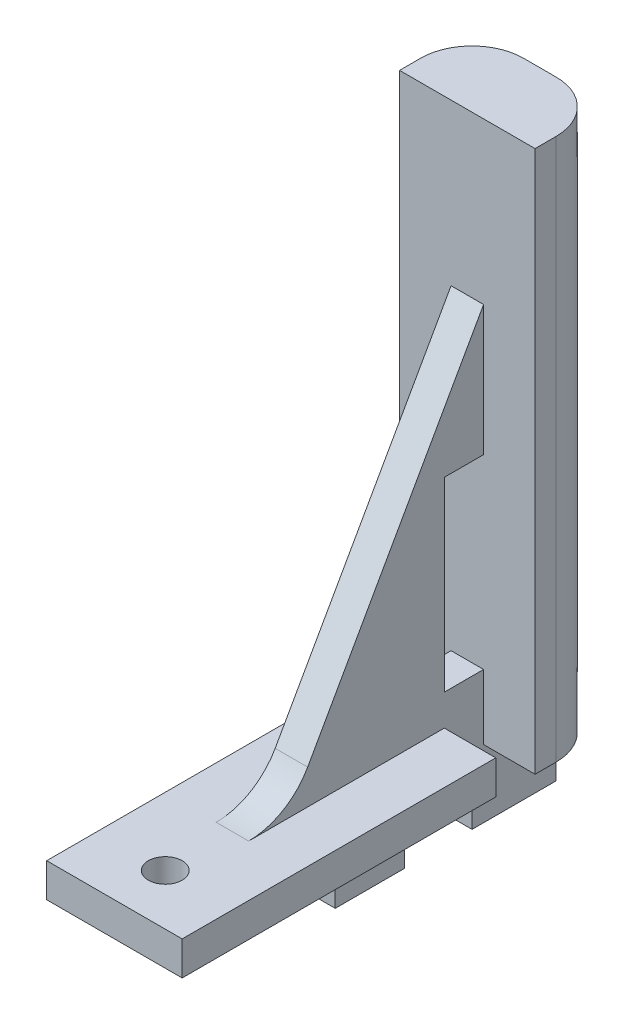
ISO-10303-21;
HEADER;
FILE_DESCRIPTION(('STEP AP214'),'2;1');
FILE_NAME('part.step','',(''),(''),'','','');
FILE_SCHEMA(('AUTOMOTIVE_DESIGN { 1 0 10303 214 1 1 1 1 }'));
ENDSEC;
DATA;
#1=APPLICATION_CONTEXT('core data for automotive mechanical design processes');
#2=APPLICATION_PROTOCOL_DEFINITION('international standard','automotive_design',2000,#1);
#3=PRODUCT_CONTEXT('',#1,'mechanical');
#4=PRODUCT('Part','Part','',(#3));
#5=PRODUCT_RELATED_PRODUCT_CATEGORY('part','',(#4));
#6=PRODUCT_DEFINITION_FORMATION('','',#4);
#7=PRODUCT_DEFINITION_CONTEXT('part definition',#1,'design');
#8=PRODUCT_DEFINITION('design','',#6,#7);
#9=PRODUCT_DEFINITION_SHAPE('','',#8);
#10=(LENGTH_UNIT() NAMED_UNIT(*) SI_UNIT(.MILLI.,.METRE.));
#11=(NAMED_UNIT(*) PLANE_ANGLE_UNIT() SI_UNIT($,.RADIAN.));
#12=(NAMED_UNIT(*) SI_UNIT($,.STERADIAN.) SOLID_ANGLE_UNIT());
#13=UNCERTAINTY_MEASURE_WITH_UNIT(LENGTH_MEASURE(1.E-05),#10,'distance_accuracy_value','');
#14=(GEOMETRIC_REPRESENTATION_CONTEXT(3) GLOBAL_UNCERTAINTY_ASSIGNED_CONTEXT((#13)) GLOBAL_UNIT_ASSIGNED_CONTEXT((#10,
#11,#12)) REPRESENTATION_CONTEXT('',''));
#15=CARTESIAN_POINT('',(0.,0.,0.));
#16=DIRECTION('',(0.,0.,1.));
#17=DIRECTION('',(1.,0.,0.));
#18=AXIS2_PLACEMENT_3D('',#15,#16,#17);
#19=CARTESIAN_POINT('',(-6.35,0.,0.));
#20=DIRECTION('',(1.,0.,0.));
#21=DIRECTION('',(0.,0.,-1.));
#22=AXIS2_PLACEMENT_3D('',#19,#20,#21);
#23=PLANE('',#22);
#24=DIRECTION('',(0.,0.,-1.));
#25=VECTOR('',#24,1.);
#26=CARTESIAN_POINT('',(-6.35,0.,0.));
#27=LINE('',#26,#25);
#28=CARTESIAN_POINT('',(-6.35,0.,-13.1445));
#29=VERTEX_POINT('',#28);
#30=CARTESIAN_POINT('',(-6.35,0.,-15.113));
#31=VERTEX_POINT('',#30);
#32=EDGE_CURVE('E273',#29,#31,#27,.T.);
#33=ORIENTED_EDGE('',*,*,#32,.F.);
#34=DIRECTION('',(0.,1.,0.));
#35=VECTOR('',#34,1.);
#36=CARTESIAN_POINT('',(-6.35,0.,-13.1445));
#37=LINE('',#36,#35);
#38=CARTESIAN_POINT('',(-6.35,50.8,-13.1445));
#39=VERTEX_POINT('',#38);
#40=EDGE_CURVE('E500',#29,#39,#37,.T.);
#41=ORIENTED_EDGE('',*,*,#40,.T.);
#42=DIRECTION('',(0.,0.,1.));
#43=VECTOR('',#42,1.);
#44=CARTESIAN_POINT('',(-6.35,50.8,0.));
#45=LINE('',#44,#43);
#46=CARTESIAN_POINT('',(-6.35,50.8,-15.113));
#47=VERTEX_POINT('',#46);
#48=EDGE_CURVE('E272',#47,#39,#45,.T.);
#49=ORIENTED_EDGE('',*,*,#48,.F.);
#50=DIRECTION('',(0.,1.,0.));
#51=VECTOR('',#50,1.);
#52=CARTESIAN_POINT('',(-6.35,0.,-15.113));
#53=LINE('',#52,#51);
#54=EDGE_CURVE('E325',#47,#31,#53,.F.);
#55=ORIENTED_EDGE('',*,*,#54,.T.);
#56=EDGE_LOOP('',(#33,#41,#49,#55));
#57=FACE_BOUND('',#56,.T.);
#58=ADVANCED_FACE('F41',(#57),#23,.F.);
#59=DIRECTION('',(0.,-1.,0.));
#60=VECTOR('',#59,1.);
#61=CARTESIAN_POINT('',(-6.35,0.,-9.4615));
#62=LINE('',#61,#60);
#63=CARTESIAN_POINT('',(-6.35,3.17500000000002,-9.4615));
#64=VERTEX_POINT('',#63);
#65=CARTESIAN_POINT('',(-6.35,0.,-9.4615));
#66=VERTEX_POINT('',#65);
#67=EDGE_CURVE('E248',#64,#66,#62,.T.);
#68=ORIENTED_EDGE('',*,*,#67,.T.);
#69=CARTESIAN_POINT('',(-6.35,0.,19.939));
#70=VERTEX_POINT('',#69);
#71=EDGE_CURVE('E263',#70,#66,#27,.T.);
#72=ORIENTED_EDGE('',*,*,#71,.F.);
#73=DIRECTION('',(0.,1.,0.));
#74=VECTOR('',#73,1.);
#75=CARTESIAN_POINT('',(-6.35,0.,19.939));
#76=LINE('',#75,#74);
#77=CARTESIAN_POINT('',(-6.35,3.175,19.939));
#78=VERTEX_POINT('',#77);
#79=EDGE_CURVE('E280',#70,#78,#76,.T.);
#80=ORIENTED_EDGE('',*,*,#79,.T.);
#81=DIRECTION('',(0.,0.,1.));
#82=VECTOR('',#81,1.);
#83=CARTESIAN_POINT('',(-6.35,3.17500000000002,0.));
#84=LINE('',#83,#82);
#85=EDGE_CURVE('E265',#64,#78,#84,.T.);
#86=ORIENTED_EDGE('',*,*,#85,.F.);
#87=EDGE_LOOP('',(#68,#72,#80,#86));
#88=FACE_BOUND('',#87,.T.);
#89=ADVANCED_FACE('F261',(#88),#23,.F.);
#90=CARTESIAN_POINT('',(6.35,0.,0.));
#91=DIRECTION('',(0.,1.,0.));
#92=DIRECTION('',(0.,0.,1.));
#93=AXIS2_PLACEMENT_3D('',#90,#91,#92);
#94=PLANE('',#93);
#95=DIRECTION('',(-1.,0.,0.));
#96=VECTOR('',#95,1.);
#97=CARTESIAN_POINT('',(5.59819804554749,0.,-13.1445));
#98=LINE('',#97,#96);
#99=CARTESIAN_POINT('',(-1.524,0.,-13.1445));
#100=VERTEX_POINT('',#99);
#101=EDGE_CURVE('E256',#100,#29,#98,.T.);
#102=ORIENTED_EDGE('',*,*,#101,.T.);
#103=ORIENTED_EDGE('',*,*,#32,.T.);
#104=CARTESIAN_POINT('',(-1.524,0.,-15.113));
#105=DIRECTION('',(0.,1.,0.));
#106=DIRECTION('',(0.,0.,1.));
#107=AXIS2_PLACEMENT_3D('',#104,#105,#106);
#108=CIRCLE('',#107,4.826);
#109=CARTESIAN_POINT('',(-1.524,0.,-19.939));
#110=VERTEX_POINT('',#109);
#111=EDGE_CURVE('E333',#31,#110,#108,.F.);
#112=ORIENTED_EDGE('',*,*,#111,.T.);
#113=DIRECTION('',(0.,0.,-1.));
#114=VECTOR('',#113,1.);
#115=CARTESIAN_POINT('',(-1.524,0.,0.));
#116=LINE('',#115,#114);
#117=EDGE_CURVE('E456',#100,#110,#116,.T.);
#118=ORIENTED_EDGE('',*,*,#117,.F.);
#119=EDGE_LOOP('',(#102,#103,#112,#118));
#120=FACE_BOUND('',#119,.T.);
#121=ADVANCED_FACE('F604',(#120),#94,.F.);
#122=DIRECTION('',(-1.,0.,0.));
#123=VECTOR('',#122,1.);
#124=CARTESIAN_POINT('',(1.524,0.,0.762));
#125=LINE('',#124,#123);
#126=CARTESIAN_POINT('',(1.524,0.,0.762));
#127=VERTEX_POINT('',#126);
#128=CARTESIAN_POINT('',(-1.524,0.,0.762));
#129=VERTEX_POINT('',#128);
#130=EDGE_CURVE('E449',#127,#129,#125,.T.);
#131=ORIENTED_EDGE('',*,*,#130,.F.);
#132=DIRECTION('',(0.,0.,-1.));
#133=VECTOR('',#132,1.);
#134=CARTESIAN_POINT('',(1.524,0.,0.));
#135=LINE('',#134,#133);
#136=CARTESIAN_POINT('',(1.524,0.,-5.715));
#137=VERTEX_POINT('',#136);
#138=EDGE_CURVE('E419',#127,#137,#135,.T.);
#139=ORIENTED_EDGE('',*,*,#138,.T.);
#140=DIRECTION('',(-1.,0.,0.));
#141=VECTOR('',#140,1.);
#142=CARTESIAN_POINT('',(1.524,0.,-5.715));
#143=LINE('',#142,#141);
#144=CARTESIAN_POINT('',(-1.524,0.,-5.715));
#145=VERTEX_POINT('',#144);
#146=EDGE_CURVE('E453',#137,#145,#143,.T.);
#147=ORIENTED_EDGE('',*,*,#146,.T.);
#148=DIRECTION('',(0.,0.,-1.));
#149=VECTOR('',#148,1.);
#150=CARTESIAN_POINT('',(-1.524,0.,0.));
#151=LINE('',#150,#149);
#152=EDGE_CURVE('E433',#129,#145,#151,.T.);
#153=ORIENTED_EDGE('',*,*,#152,.F.);
#154=EDGE_LOOP('',(#131,#139,#147,#153));
#155=FACE_BOUND('',#154,.T.);
#156=CARTESIAN_POINT('',(0.,0.,15.1765));
#157=DIRECTION('',(0.,-1.,0.));
#158=DIRECTION('',(0.,0.,-1.));
#159=AXIS2_PLACEMENT_3D('',#156,#157,#158);
#160=CIRCLE('',#159,1.5875);
#161=CARTESIAN_POINT('',(0.,0.,13.589));
#162=VERTEX_POINT('',#161);
#163=EDGE_CURVE('E309',#162,#162,#160,.T.);
#164=ORIENTED_EDGE('',*,*,#163,.F.);
#165=EDGE_LOOP('',(#164));
#166=FACE_BOUND('',#165,.T.);
#167=DIRECTION('',(-1.,0.,0.));
#168=VECTOR('',#167,1.);
#169=CARTESIAN_POINT('',(5.59819804554749,0.,-9.4615));
#170=LINE('',#169,#168);
#171=CARTESIAN_POINT('',(-1.524,0.,-9.4615));
#172=VERTEX_POINT('',#171);
#173=EDGE_CURVE('E245',#172,#66,#170,.T.);
#174=ORIENTED_EDGE('',*,*,#173,.F.);
#175=DIRECTION('',(0.,0.,1.));
#176=VECTOR('',#175,1.);
#177=CARTESIAN_POINT('',(-1.524,0.,0.));
#178=LINE('',#177,#176);
#179=CARTESIAN_POINT('',(-1.524,0.,-12.065));
#180=VERTEX_POINT('',#179);
#181=EDGE_CURVE('E255',#180,#172,#178,.T.);
#182=ORIENTED_EDGE('',*,*,#181,.F.);
#183=DIRECTION('',(-1.,0.,0.));
#184=VECTOR('',#183,1.);
#185=CARTESIAN_POINT('',(1.524,0.,-12.065));
#186=LINE('',#185,#184);
#187=CARTESIAN_POINT('',(1.524,0.,-12.065));
#188=VERTEX_POINT('',#187);
#189=EDGE_CURVE('E491',#188,#180,#186,.T.);
#190=ORIENTED_EDGE('',*,*,#189,.F.);
#191=DIRECTION('',(0.,0.,-1.));
#192=VECTOR('',#191,1.);
#193=CARTESIAN_POINT('',(1.524,0.,-9.4615));
#194=LINE('',#193,#192);
#195=CARTESIAN_POINT('',(1.524,0.,-9.4615));
#196=VERTEX_POINT('',#195);
#197=EDGE_CURVE('E549',#196,#188,#194,.T.);
#198=ORIENTED_EDGE('',*,*,#197,.F.);
#199=DIRECTION('',(1.,0.,0.));
#200=VECTOR('',#199,1.);
#201=CARTESIAN_POINT('',(-5.59819804554748,0.,-9.4615));
#202=LINE('',#201,#200);
#203=CARTESIAN_POINT('',(6.35,0.,-9.4615));
#204=VERTEX_POINT('',#203);
#205=EDGE_CURVE('E561',#196,#204,#202,.T.);
#206=ORIENTED_EDGE('',*,*,#205,.T.);
#207=DIRECTION('',(0.,0.,-1.));
#208=VECTOR('',#207,1.);
#209=CARTESIAN_POINT('',(6.35,0.,0.));
#210=LINE('',#209,#208);
#211=CARTESIAN_POINT('',(6.35,0.,19.939));
#212=VERTEX_POINT('',#211);
#213=EDGE_CURVE('E522',#212,#204,#210,.T.);
#214=ORIENTED_EDGE('',*,*,#213,.F.);
#215=DIRECTION('',(-1.,0.,0.));
#216=VECTOR('',#215,1.);
#217=CARTESIAN_POINT('',(6.35,0.,19.939));
#218=LINE('',#217,#216);
#219=EDGE_CURVE('E270',#212,#70,#218,.T.);
#220=ORIENTED_EDGE('',*,*,#219,.T.);
#221=ORIENTED_EDGE('',*,*,#71,.T.);
#222=EDGE_LOOP('',(#174,#182,#190,#198,#206,#214,#220,#221));
#223=FACE_BOUND('',#222,.T.);
#224=ADVANCED_FACE('F268',(#155,#166,#223),#94,.F.);
#225=CARTESIAN_POINT('',(6.35,3.17500000000002,0.));
#226=DIRECTION('',(0.,-1.,0.));
#227=DIRECTION('',(0.,0.,-1.));
#228=AXIS2_PLACEMENT_3D('',#225,#226,#227);
#229=PLANE('',#228);
#230=CARTESIAN_POINT('',(0.,3.175,15.1765));
#231=DIRECTION('',(0.,-1.,0.));
#232=DIRECTION('',(0.,0.,-1.));
#233=AXIS2_PLACEMENT_3D('',#230,#231,#232);
#234=CIRCLE('',#233,1.5875);
#235=CARTESIAN_POINT('',(0.,3.17500000000001,13.589));
#236=VERTEX_POINT('',#235);
#237=EDGE_CURVE('E304',#236,#236,#234,.T.);
#238=ORIENTED_EDGE('',*,*,#237,.T.);
#239=EDGE_LOOP('',(#238));
#240=FACE_BOUND('',#239,.T.);
#241=DIRECTION('',(1.,0.,0.));
#242=VECTOR('',#241,1.);
#243=CARTESIAN_POINT('',(6.35,3.17500000000002,-9.4615));
#244=LINE('',#243,#242);
#245=CARTESIAN_POINT('',(-1.524,3.17500000000001,-9.4615));
#246=VERTEX_POINT('',#245);
#247=EDGE_CURVE('E550',#64,#246,#244,.T.);
#248=ORIENTED_EDGE('',*,*,#247,.F.);
#249=ORIENTED_EDGE('',*,*,#85,.T.);
#250=DIRECTION('',(-1.,0.,0.));
#251=VECTOR('',#250,1.);
#252=CARTESIAN_POINT('',(6.35,3.175,19.939));
#253=LINE('',#252,#251);
#254=CARTESIAN_POINT('',(6.35,3.175,19.939));
#255=VERTEX_POINT('',#254);
#256=EDGE_CURVE('E295',#255,#78,#253,.T.);
#257=ORIENTED_EDGE('',*,*,#256,.F.);
#258=DIRECTION('',(0.,0.,1.));
#259=VECTOR('',#258,1.);
#260=CARTESIAN_POINT('',(6.35,3.17500000000002,0.));
#261=LINE('',#260,#259);
#262=CARTESIAN_POINT('',(6.35,3.17500000000002,-9.4615));
#263=VERTEX_POINT('',#262);
#264=EDGE_CURVE('E514',#263,#255,#261,.T.);
#265=ORIENTED_EDGE('',*,*,#264,.F.);
#266=DIRECTION('',(-1.,0.,0.));
#267=VECTOR('',#266,1.);
#268=CARTESIAN_POINT('',(6.35,3.17500000000002,-9.4615));
#269=LINE('',#268,#267);
#270=CARTESIAN_POINT('',(1.524,3.17500000000002,-9.4615));
#271=VERTEX_POINT('',#270);
#272=EDGE_CURVE('E540',#263,#271,#269,.T.);
#273=ORIENTED_EDGE('',*,*,#272,.T.);
#274=DIRECTION('',(0.,0.,1.));
#275=VECTOR('',#274,1.);
#276=CARTESIAN_POINT('',(1.524,3.17500000000002,0.));
#277=LINE('',#276,#275);
#278=CARTESIAN_POINT('',(1.524,3.17500000000001,8.88109407367843));
#279=VERTEX_POINT('',#278);
#280=EDGE_CURVE('E569',#271,#279,#277,.T.);
#281=ORIENTED_EDGE('',*,*,#280,.T.);
#282=DIRECTION('',(-1.,0.,0.));
#283=VECTOR('',#282,1.);
#284=CARTESIAN_POINT('',(-6.35,3.17500000000001,8.88109407367843));
#285=LINE('',#284,#283);
#286=CARTESIAN_POINT('',(-1.524,3.17500000000001,8.88109407367843));
#287=VERTEX_POINT('',#286);
#288=EDGE_CURVE('E341',#279,#287,#285,.T.);
#289=ORIENTED_EDGE('',*,*,#288,.T.);
#290=DIRECTION('',(0.,0.,1.));
#291=VECTOR('',#290,1.);
#292=CARTESIAN_POINT('',(-1.524,3.17500000000002,0.));
#293=LINE('',#292,#291);
#294=EDGE_CURVE('E570',#246,#287,#293,.T.);
#295=ORIENTED_EDGE('',*,*,#294,.F.);
#296=EDGE_LOOP('',(#248,#249,#257,#265,#273,#281,#289,#295));
#297=FACE_BOUND('',#296,.T.);
#298=ADVANCED_FACE('F538',(#240,#297),#229,.F.);
#299=CARTESIAN_POINT('',(6.35,0.,0.));
#300=DIRECTION('',(1.,0.,0.));
#301=DIRECTION('',(0.,0.,-1.));
#302=AXIS2_PLACEMENT_3D('',#299,#300,#301);
#303=PLANE('',#302);
#304=DIRECTION('',(0.,1.,0.));
#305=VECTOR('',#304,1.);
#306=CARTESIAN_POINT('',(6.35,0.,-13.1445));
#307=LINE('',#306,#305);
#308=CARTESIAN_POINT('',(6.35,0.,-13.1445));
#309=VERTEX_POINT('',#308);
#310=CARTESIAN_POINT('',(6.35,50.8,-13.1445));
#311=VERTEX_POINT('',#310);
#312=EDGE_CURVE('E278',#309,#311,#307,.T.);
#313=ORIENTED_EDGE('',*,*,#312,.F.);
#314=CARTESIAN_POINT('',(6.35,0.,-15.113));
#315=VERTEX_POINT('',#314);
#316=EDGE_CURVE('E521',#309,#315,#210,.T.);
#317=ORIENTED_EDGE('',*,*,#316,.T.);
#318=DIRECTION('',(0.,1.,0.));
#319=VECTOR('',#318,1.);
#320=CARTESIAN_POINT('',(6.35,50.8,-15.113));
#321=LINE('',#320,#319);
#322=CARTESIAN_POINT('',(6.35,50.8,-15.113));
#323=VERTEX_POINT('',#322);
#324=EDGE_CURVE('E337',#315,#323,#321,.T.);
#325=ORIENTED_EDGE('',*,*,#324,.T.);
#326=DIRECTION('',(0.,0.,1.));
#327=VECTOR('',#326,1.);
#328=CARTESIAN_POINT('',(6.35,50.8,0.));
#329=LINE('',#328,#327);
#330=EDGE_CURVE('E289',#323,#311,#329,.T.);
#331=ORIENTED_EDGE('',*,*,#330,.T.);
#332=EDGE_LOOP('',(#313,#317,#325,#331));
#333=FACE_BOUND('',#332,.T.);
#334=ADVANCED_FACE('F646',(#333),#303,.T.);
#335=ORIENTED_EDGE('',*,*,#316,.F.);
#336=DIRECTION('',(1.,0.,0.));
#337=VECTOR('',#336,1.);
#338=CARTESIAN_POINT('',(-5.59819804554748,0.,-13.1445));
#339=LINE('',#338,#337);
#340=CARTESIAN_POINT('',(1.524,0.,-13.1445));
#341=VERTEX_POINT('',#340);
#342=EDGE_CURVE('E554',#341,#309,#339,.T.);
#343=ORIENTED_EDGE('',*,*,#342,.F.);
#344=DIRECTION('',(0.,0.,-1.));
#345=VECTOR('',#344,1.);
#346=CARTESIAN_POINT('',(1.524,0.,0.));
#347=LINE('',#346,#345);
#348=CARTESIAN_POINT('',(1.524,0.,-19.939));
#349=VERTEX_POINT('',#348);
#350=EDGE_CURVE('E457',#341,#349,#347,.T.);
#351=ORIENTED_EDGE('',*,*,#350,.T.);
#352=CARTESIAN_POINT('',(1.524,0.,-15.113));
#353=DIRECTION('',(0.,1.,0.));
#354=DIRECTION('',(0.,0.,1.));
#355=AXIS2_PLACEMENT_3D('',#352,#353,#354);
#356=CIRCLE('',#355,4.826);
#357=EDGE_CURVE('E329',#349,#315,#356,.F.);
#358=ORIENTED_EDGE('',*,*,#357,.T.);
#359=EDGE_LOOP('',(#335,#343,#351,#358));
#360=FACE_BOUND('',#359,.T.);
#361=ADVANCED_FACE('F642',(#360),#94,.F.);
#362=DIRECTION('',(0.,-1.,0.));
#363=VECTOR('',#362,1.);
#364=CARTESIAN_POINT('',(6.35,6.09600000000003,-9.4615));
#365=LINE('',#364,#363);
#366=EDGE_CURVE('E544',#263,#204,#365,.T.);
#367=ORIENTED_EDGE('',*,*,#366,.F.);
#368=ORIENTED_EDGE('',*,*,#264,.T.);
#369=DIRECTION('',(0.,1.,0.));
#370=VECTOR('',#369,1.);
#371=CARTESIAN_POINT('',(6.35,0.,19.939));
#372=LINE('',#371,#370);
#373=EDGE_CURVE('E517',#212,#255,#372,.T.);
#374=ORIENTED_EDGE('',*,*,#373,.F.);
#375=ORIENTED_EDGE('',*,*,#213,.T.);
#376=EDGE_LOOP('',(#367,#368,#374,#375));
#377=FACE_BOUND('',#376,.T.);
#378=ADVANCED_FACE('F543',(#377),#303,.T.);
#379=CARTESIAN_POINT('',(6.35,2.97112168207122,5.28199410145995));
#380=DIRECTION('',(0.,-0.490261239632559,-0.871575537124549));
#381=DIRECTION('',(0.,0.871575537124549,-0.490261239632559));
#382=AXIS2_PLACEMENT_3D('',#379,#380,#381);
#383=PLANE('',#382);
#384=DIRECTION('',(0.,0.871575537124549,-0.490261239632559));
#385=VECTOR('',#384,1.);
#386=CARTESIAN_POINT('',(-1.524,2.97112168207122,5.28199410145995));
#387=LINE('',#386,#385);
#388=CARTESIAN_POINT('',(-1.524,6.41184112833326,3.34658941293755));
#389=VERTEX_POINT('',#388);
#390=CARTESIAN_POINT('',(-1.524,35.729333418,-13.1445));
#391=VERTEX_POINT('',#390);
#392=EDGE_CURVE('E367',#389,#391,#387,.T.);
#393=ORIENTED_EDGE('',*,*,#392,.F.);
#394=DIRECTION('',(-1.,0.,0.));
#395=VECTOR('',#394,1.);
#396=CARTESIAN_POINT('',(6.35,6.41184112833326,3.34658941293755));
#397=LINE('',#396,#395);
#398=CARTESIAN_POINT('',(1.524,6.41184112833326,3.34658941293755));
#399=VERTEX_POINT('',#398);
#400=EDGE_CURVE('E345',#389,#399,#397,.F.);
#401=ORIENTED_EDGE('',*,*,#400,.T.);
#402=DIRECTION('',(0.,0.871575537124549,-0.490261239632559));
#403=VECTOR('',#402,1.);
#404=CARTESIAN_POINT('',(1.524,2.97112168207122,5.28199410145995));
#405=LINE('',#404,#403);
#406=CARTESIAN_POINT('',(1.524,35.729333418,-13.1445));
#407=VERTEX_POINT('',#406);
#408=EDGE_CURVE('E65',#399,#407,#405,.T.);
#409=ORIENTED_EDGE('',*,*,#408,.T.);
#410=DIRECTION('',(-1.,0.,0.));
#411=VECTOR('',#410,1.);
#412=CARTESIAN_POINT('',(6.35,35.729333418,-13.1445));
#413=LINE('',#412,#411);
#414=EDGE_CURVE('E299',#407,#391,#413,.T.);
#415=ORIENTED_EDGE('',*,*,#414,.T.);
#416=EDGE_LOOP('',(#393,#401,#409,#415));
#417=FACE_BOUND('',#416,.T.);
#418=ADVANCED_FACE('F365',(#417),#383,.F.);
#419=CARTESIAN_POINT('',(-6.35,23.537333418,0.));
#420=DIRECTION('',(0.,-1.,0.));
#421=DIRECTION('',(0.,0.,-1.));
#422=AXIS2_PLACEMENT_3D('',#419,#420,#421);
#423=PLANE('',#422);
#424=DIRECTION('',(1.,0.,0.));
#425=VECTOR('',#424,1.);
#426=CARTESIAN_POINT('',(-6.35,23.537333418,-9.4615));
#427=LINE('',#426,#425);
#428=CARTESIAN_POINT('',(-1.524,23.537333418,-9.4615));
#429=VERTEX_POINT('',#428);
#430=CARTESIAN_POINT('',(1.524,23.537333418,-9.4615));
#431=VERTEX_POINT('',#430);
#432=EDGE_CURVE('E495',#429,#431,#427,.T.);
#433=ORIENTED_EDGE('',*,*,#432,.F.);
#434=DIRECTION('',(0.,0.,-1.));
#435=VECTOR('',#434,1.);
#436=CARTESIAN_POINT('',(-1.524,23.537333418,0.));
#437=LINE('',#436,#435);
#438=CARTESIAN_POINT('',(-1.524,23.537333418,-13.1445));
#439=VERTEX_POINT('',#438);
#440=EDGE_CURVE('E384',#429,#439,#437,.T.);
#441=ORIENTED_EDGE('',*,*,#440,.T.);
#442=DIRECTION('',(1.,0.,0.));
#443=VECTOR('',#442,1.);
#444=CARTESIAN_POINT('',(-6.35,23.537333418,-13.1445));
#445=LINE('',#444,#443);
#446=CARTESIAN_POINT('',(1.524,23.537333418,-13.1445));
#447=VERTEX_POINT('',#446);
#448=EDGE_CURVE('E496',#439,#447,#445,.T.);
#449=ORIENTED_EDGE('',*,*,#448,.T.);
#450=DIRECTION('',(0.,0.,-1.));
#451=VECTOR('',#450,1.);
#452=CARTESIAN_POINT('',(1.524,23.537333418,0.));
#453=LINE('',#452,#451);
#454=EDGE_CURVE('E371',#431,#447,#453,.T.);
#455=ORIENTED_EDGE('',*,*,#454,.F.);
#456=EDGE_LOOP('',(#433,#441,#449,#455));
#457=FACE_BOUND('',#456,.T.);
#458=ADVANCED_FACE('F693',(#457),#423,.T.);
#459=CARTESIAN_POINT('',(-6.35,6.09600000000003,0.));
#460=DIRECTION('',(0.,-1.,0.));
#461=DIRECTION('',(0.,0.,-1.));
#462=AXIS2_PLACEMENT_3D('',#459,#460,#461);
#463=PLANE('',#462);
#464=DIRECTION('',(0.,0.,-1.));
#465=VECTOR('',#464,1.);
#466=CARTESIAN_POINT('',(-1.524,6.09600000000003,0.));
#467=LINE('',#466,#465);
#468=CARTESIAN_POINT('',(-1.524,6.09600000000003,-9.4615));
#469=VERTEX_POINT('',#468);
#470=CARTESIAN_POINT('',(-1.524,6.09600000000003,-13.1445));
#471=VERTEX_POINT('',#470);
#472=EDGE_CURVE('E376',#469,#471,#467,.T.);
#473=ORIENTED_EDGE('',*,*,#472,.F.);
#474=DIRECTION('',(1.,0.,0.));
#475=VECTOR('',#474,1.);
#476=CARTESIAN_POINT('',(-6.35,6.09600000000003,-9.4615));
#477=LINE('',#476,#475);
#478=CARTESIAN_POINT('',(1.524,6.09600000000003,-9.4615));
#479=VERTEX_POINT('',#478);
#480=EDGE_CURVE('E505',#469,#479,#477,.T.);
#481=ORIENTED_EDGE('',*,*,#480,.T.);
#482=DIRECTION('',(0.,0.,-1.));
#483=VECTOR('',#482,1.);
#484=CARTESIAN_POINT('',(1.524,6.09600000000003,0.));
#485=LINE('',#484,#483);
#486=CARTESIAN_POINT('',(1.524,6.09600000000003,-13.1445));
#487=VERTEX_POINT('',#486);
#488=EDGE_CURVE('E378',#479,#487,#485,.T.);
#489=ORIENTED_EDGE('',*,*,#488,.T.);
#490=DIRECTION('',(1.,0.,0.));
#491=VECTOR('',#490,1.);
#492=CARTESIAN_POINT('',(-6.35,6.09600000000003,-13.1445));
#493=LINE('',#492,#491);
#494=EDGE_CURVE('E501',#471,#487,#493,.T.);
#495=ORIENTED_EDGE('',*,*,#494,.F.);
#496=EDGE_LOOP('',(#473,#481,#489,#495));
#497=FACE_BOUND('',#496,.T.);
#498=ADVANCED_FACE('F591',(#497),#463,.F.);
#499=CARTESIAN_POINT('',(-6.35,0.,-9.4615));
#500=DIRECTION('',(0.,0.,-1.));
#501=DIRECTION('',(-1.,0.,0.));
#502=AXIS2_PLACEMENT_3D('',#499,#500,#501);
#503=PLANE('',#502);
#504=ORIENTED_EDGE('',*,*,#480,.F.);
#505=DIRECTION('',(0.,1.,0.));
#506=VECTOR('',#505,1.);
#507=CARTESIAN_POINT('',(-1.524,0.,-9.4615));
#508=LINE('',#507,#506);
#509=EDGE_CURVE('E370',#469,#429,#508,.T.);
#510=ORIENTED_EDGE('',*,*,#509,.T.);
#511=ORIENTED_EDGE('',*,*,#432,.T.);
#512=DIRECTION('',(0.,1.,0.));
#513=VECTOR('',#512,1.);
#514=CARTESIAN_POINT('',(1.524,0.,-9.4615));
#515=LINE('',#514,#513);
#516=EDGE_CURVE('E584',#479,#431,#515,.T.);
#517=ORIENTED_EDGE('',*,*,#516,.F.);
#518=EDGE_LOOP('',(#504,#510,#511,#517));
#519=FACE_BOUND('',#518,.T.);
#520=ADVANCED_FACE('F893',(#519),#503,.T.);
#521=CARTESIAN_POINT('',(6.35,9.52500000000001,8.88109407367843));
#522=DIRECTION('',(1.,0.,0.));
#523=DIRECTION('',(0.,0.,-1.));
#524=AXIS2_PLACEMENT_3D('',#521,#522,#523);
#525=CYLINDRICAL_SURFACE('',#524,6.35);
#526=CARTESIAN_POINT('',(-1.524,9.52500000000001,8.88109407367843));
#527=DIRECTION('',(-1.,0.,0.));
#528=DIRECTION('',(0.,0.,1.));
#529=AXIS2_PLACEMENT_3D('',#526,#527,#528);
#530=CIRCLE('',#529,6.35);
#531=EDGE_CURVE('E11',#287,#389,#530,.F.);
#532=ORIENTED_EDGE('',*,*,#531,.F.);
#533=ORIENTED_EDGE('',*,*,#288,.F.);
#534=CARTESIAN_POINT('',(1.524,9.52500000000001,8.88109407367843));
#535=DIRECTION('',(-1.,0.,0.));
#536=DIRECTION('',(0.,0.,1.));
#537=AXIS2_PLACEMENT_3D('',#534,#535,#536);
#538=CIRCLE('',#537,6.35);
#539=EDGE_CURVE('E50',#279,#399,#538,.F.);
#540=ORIENTED_EDGE('',*,*,#539,.T.);
#541=ORIENTED_EDGE('',*,*,#400,.F.);
#542=EDGE_LOOP('',(#532,#533,#540,#541));
#543=FACE_BOUND('',#542,.T.);
#544=ADVANCED_FACE('F43',(#543),#525,.F.);
#545=CARTESIAN_POINT('',(6.35,0.,-19.939));
#546=DIRECTION('',(0.,0.,1.));
#547=DIRECTION('',(1.,0.,0.));
#548=AXIS2_PLACEMENT_3D('',#545,#546,#547);
#549=PLANE('',#548);
#550=DIRECTION('',(0.,1.,0.));
#551=VECTOR('',#550,1.);
#552=CARTESIAN_POINT('',(-1.524,0.,-19.939));
#553=LINE('',#552,#551);
#554=CARTESIAN_POINT('',(-1.524,28.575,-19.939));
#555=VERTEX_POINT('',#554);
#556=EDGE_CURVE('E315',#110,#555,#553,.T.);
#557=ORIENTED_EDGE('',*,*,#556,.T.);
#558=DIRECTION('',(1.,0.,0.));
#559=VECTOR('',#558,1.);
#560=CARTESIAN_POINT('',(-6.35,28.575,-19.939));
#561=LINE('',#560,#559);
#562=CARTESIAN_POINT('',(1.524,28.575,-19.939));
#563=VERTEX_POINT('',#562);
#564=EDGE_CURVE('E389',#555,#563,#561,.T.);
#565=ORIENTED_EDGE('',*,*,#564,.T.);
#566=DIRECTION('',(0.,1.,0.));
#567=VECTOR('',#566,1.);
#568=CARTESIAN_POINT('',(1.524,0.,-19.939));
#569=LINE('',#568,#567);
#570=EDGE_CURVE('E303',#563,#349,#569,.F.);
#571=ORIENTED_EDGE('',*,*,#570,.T.);
#572=DIRECTION('',(0.,-1.,0.));
#573=VECTOR('',#572,1.);
#574=CARTESIAN_POINT('',(1.524,0.,-19.939));
#575=LINE('',#574,#573);
#576=CARTESIAN_POINT('',(1.524,-6.34999999999996,-19.939));
#577=VERTEX_POINT('',#576);
#578=EDGE_CURVE('E468',#349,#577,#575,.T.);
#579=ORIENTED_EDGE('',*,*,#578,.T.);
#580=DIRECTION('',(-1.,0.,0.));
#581=VECTOR('',#580,1.);
#582=CARTESIAN_POINT('',(1.524,-6.34999999999996,-19.939));
#583=LINE('',#582,#581);
#584=CARTESIAN_POINT('',(-1.524,-6.34999999999996,-19.939));
#585=VERTEX_POINT('',#584);
#586=EDGE_CURVE('E472',#577,#585,#583,.T.);
#587=ORIENTED_EDGE('',*,*,#586,.T.);
#588=DIRECTION('',(0.,-1.,0.));
#589=VECTOR('',#588,1.);
#590=CARTESIAN_POINT('',(-1.524,0.,-19.939));
#591=LINE('',#590,#589);
#592=EDGE_CURVE('E461',#110,#585,#591,.T.);
#593=ORIENTED_EDGE('',*,*,#592,.F.);
#594=EDGE_LOOP('',(#557,#565,#571,#579,#587,#593));
#595=FACE_BOUND('',#594,.T.);
#596=ADVANCED_FACE('F612',(#595),#549,.F.);
#597=CARTESIAN_POINT('',(6.35,0.,-13.1445));
#598=DIRECTION('',(0.,0.,1.));
#599=DIRECTION('',(1.,0.,0.));
#600=AXIS2_PLACEMENT_3D('',#597,#598,#599);
#601=PLANE('',#600);
#602=DIRECTION('',(0.,1.,0.));
#603=VECTOR('',#602,1.);
#604=CARTESIAN_POINT('',(-1.524,-30.2586394705991,-13.1445));
#605=LINE('',#604,#603);
#606=EDGE_CURVE('E57',#100,#471,#605,.T.);
#607=ORIENTED_EDGE('',*,*,#606,.T.);
#608=ORIENTED_EDGE('',*,*,#494,.T.);
#609=DIRECTION('',(0.,1.,0.));
#610=VECTOR('',#609,1.);
#611=CARTESIAN_POINT('',(1.524,-30.2586394705991,-13.1445));
#612=LINE('',#611,#610);
#613=EDGE_CURVE('E579',#341,#487,#612,.T.);
#614=ORIENTED_EDGE('',*,*,#613,.F.);
#615=ORIENTED_EDGE('',*,*,#342,.T.);
#616=ORIENTED_EDGE('',*,*,#312,.T.);
#617=DIRECTION('',(-1.,0.,0.));
#618=VECTOR('',#617,1.);
#619=CARTESIAN_POINT('',(6.35,50.8,-13.1445));
#620=LINE('',#619,#618);
#621=EDGE_CURVE('E284',#311,#39,#620,.T.);
#622=ORIENTED_EDGE('',*,*,#621,.T.);
#623=ORIENTED_EDGE('',*,*,#40,.F.);
#624=ORIENTED_EDGE('',*,*,#101,.F.);
#625=EDGE_LOOP('',(#607,#608,#614,#615,#616,#622,#623,#624));
#626=FACE_BOUND('',#625,.T.);
#627=EDGE_CURVE('E575',#439,#391,#605,.T.);
#628=ORIENTED_EDGE('',*,*,#627,.T.);
#629=ORIENTED_EDGE('',*,*,#414,.F.);
#630=EDGE_CURVE('E578',#447,#407,#612,.T.);
#631=ORIENTED_EDGE('',*,*,#630,.F.);
#632=ORIENTED_EDGE('',*,*,#448,.F.);
#633=EDGE_LOOP('',(#628,#629,#631,#632));
#634=FACE_BOUND('',#633,.T.);
#635=ADVANCED_FACE('F595',(#626,#634),#601,.T.);
#636=CARTESIAN_POINT('',(6.35,0.,19.939));
#637=DIRECTION('',(0.,0.,1.));
#638=DIRECTION('',(0.,-1.,0.));
#639=AXIS2_PLACEMENT_3D('',#636,#637,#638);
#640=PLANE('',#639);
#641=ORIENTED_EDGE('',*,*,#79,.F.);
#642=ORIENTED_EDGE('',*,*,#219,.F.);
#643=ORIENTED_EDGE('',*,*,#373,.T.);
#644=ORIENTED_EDGE('',*,*,#256,.T.);
#645=EDGE_LOOP('',(#641,#642,#643,#644));
#646=FACE_BOUND('',#645,.T.);
#647=ADVANCED_FACE('F535',(#646),#640,.T.);
#648=CARTESIAN_POINT('',(1.524,50.8,-19.939));
#649=VERTEX_POINT('',#648);
#650=CARTESIAN_POINT('',(1.524,38.1,-19.939));
#651=VERTEX_POINT('',#650);
#652=EDGE_CURVE('E310',#649,#651,#569,.F.);
#653=ORIENTED_EDGE('',*,*,#652,.T.);
#654=DIRECTION('',(1.,0.,0.));
#655=VECTOR('',#654,1.);
#656=CARTESIAN_POINT('',(-6.35,38.1,-19.939));
#657=LINE('',#656,#655);
#658=CARTESIAN_POINT('',(-1.524,38.1,-19.939));
#659=VERTEX_POINT('',#658);
#660=EDGE_CURVE('E388',#659,#651,#657,.T.);
#661=ORIENTED_EDGE('',*,*,#660,.F.);
#662=CARTESIAN_POINT('',(-1.524,50.8,-19.939));
#663=VERTEX_POINT('',#662);
#664=EDGE_CURVE('E314',#659,#663,#553,.T.);
#665=ORIENTED_EDGE('',*,*,#664,.T.);
#666=DIRECTION('',(-1.,0.,0.));
#667=VECTOR('',#666,1.);
#668=CARTESIAN_POINT('',(6.35,50.8,-19.939));
#669=LINE('',#668,#667);
#670=EDGE_CURVE('E288',#649,#663,#669,.T.);
#671=ORIENTED_EDGE('',*,*,#670,.F.);
#672=EDGE_LOOP('',(#653,#661,#665,#671));
#673=FACE_BOUND('',#672,.T.);
#674=ADVANCED_FACE('F655',(#673),#549,.F.);
#675=CARTESIAN_POINT('',(6.35,50.8,0.));
#676=DIRECTION('',(0.,-1.,0.));
#677=DIRECTION('',(0.,0.,-1.));
#678=AXIS2_PLACEMENT_3D('',#675,#676,#677);
#679=PLANE('',#678);
#680=ORIENTED_EDGE('',*,*,#670,.T.);
#681=CARTESIAN_POINT('',(-1.524,50.8,-15.113));
#682=DIRECTION('',(0.,-1.,0.));
#683=DIRECTION('',(0.,0.,-1.));
#684=AXIS2_PLACEMENT_3D('',#681,#682,#683);
#685=CIRCLE('',#684,4.826);
#686=EDGE_CURVE('E322',#663,#47,#685,.F.);
#687=ORIENTED_EDGE('',*,*,#686,.T.);
#688=ORIENTED_EDGE('',*,*,#48,.T.);
#689=ORIENTED_EDGE('',*,*,#621,.F.);
#690=ORIENTED_EDGE('',*,*,#330,.F.);
#691=CARTESIAN_POINT('',(1.524,50.8,-15.113));
#692=DIRECTION('',(0.,-1.,0.));
#693=DIRECTION('',(0.,0.,-1.));
#694=AXIS2_PLACEMENT_3D('',#691,#692,#693);
#695=CIRCLE('',#694,4.826);
#696=EDGE_CURVE('E319',#323,#649,#695,.F.);
#697=ORIENTED_EDGE('',*,*,#696,.T.);
#698=EDGE_LOOP('',(#680,#687,#688,#689,#690,#697));
#699=FACE_BOUND('',#698,.T.);
#700=ADVANCED_FACE('F648',(#699),#679,.F.);
#701=CARTESIAN_POINT('',(1.524,0.,-12.065));
#702=DIRECTION('',(0.,0.,-1.));
#703=DIRECTION('',(0.,1.,0.));
#704=AXIS2_PLACEMENT_3D('',#701,#702,#703);
#705=PLANE('',#704);
#706=DIRECTION('',(0.,-1.,0.));
#707=VECTOR('',#706,1.);
#708=CARTESIAN_POINT('',(-1.524,0.,-12.065));
#709=LINE('',#708,#707);
#710=CARTESIAN_POINT('',(-1.524,-6.34999999999996,-12.065));
#711=VERTEX_POINT('',#710);
#712=EDGE_CURVE('E475',#180,#711,#709,.T.);
#713=ORIENTED_EDGE('',*,*,#712,.T.);
#714=DIRECTION('',(-1.,0.,0.));
#715=VECTOR('',#714,1.);
#716=CARTESIAN_POINT('',(1.524,-6.34999999999996,-12.065));
#717=LINE('',#716,#715);
#718=CARTESIAN_POINT('',(1.524,-6.34999999999996,-12.065));
#719=VERTEX_POINT('',#718);
#720=EDGE_CURVE('E488',#719,#711,#717,.T.);
#721=ORIENTED_EDGE('',*,*,#720,.F.);
#722=DIRECTION('',(0.,-1.,0.));
#723=VECTOR('',#722,1.);
#724=CARTESIAN_POINT('',(1.524,0.,-12.065));
#725=LINE('',#724,#723);
#726=EDGE_CURVE('E460',#188,#719,#725,.T.);
#727=ORIENTED_EDGE('',*,*,#726,.F.);
#728=ORIENTED_EDGE('',*,*,#189,.T.);
#729=EDGE_LOOP('',(#713,#721,#727,#728));
#730=FACE_BOUND('',#729,.T.);
#731=ADVANCED_FACE('F681',(#730),#705,.F.);
#732=CARTESIAN_POINT('',(1.524,-6.34999999999997,0.));
#733=DIRECTION('',(0.,-1.,0.));
#734=DIRECTION('',(0.,0.,-1.));
#735=AXIS2_PLACEMENT_3D('',#732,#733,#734);
#736=PLANE('',#735);
#737=DIRECTION('',(0.,0.,1.));
#738=VECTOR('',#737,1.);
#739=CARTESIAN_POINT('',(-1.524,-6.34999999999997,0.));
#740=LINE('',#739,#738);
#741=EDGE_CURVE('E479',#585,#711,#740,.T.);
#742=ORIENTED_EDGE('',*,*,#741,.F.);
#743=ORIENTED_EDGE('',*,*,#586,.F.);
#744=DIRECTION('',(0.,0.,1.));
#745=VECTOR('',#744,1.);
#746=CARTESIAN_POINT('',(1.524,-6.34999999999997,0.));
#747=LINE('',#746,#745);
#748=EDGE_CURVE('E464',#577,#719,#747,.T.);
#749=ORIENTED_EDGE('',*,*,#748,.T.);
#750=ORIENTED_EDGE('',*,*,#720,.T.);
#751=EDGE_LOOP('',(#742,#743,#749,#750));
#752=FACE_BOUND('',#751,.T.);
#753=ADVANCED_FACE('F777',(#752),#736,.T.);
#754=CARTESIAN_POINT('',(1.524,0.,0.));
#755=DIRECTION('',(1.,0.,0.));
#756=DIRECTION('',(0.,0.,-1.));
#757=AXIS2_PLACEMENT_3D('',#754,#755,#756);
#758=PLANE('',#757);
#759=ORIENTED_EDGE('',*,*,#350,.F.);
#760=ORIENTED_EDGE('',*,*,#613,.T.);
#761=ORIENTED_EDGE('',*,*,#488,.F.);
#762=ORIENTED_EDGE('',*,*,#516,.T.);
#763=ORIENTED_EDGE('',*,*,#454,.T.);
#764=ORIENTED_EDGE('',*,*,#630,.T.);
#765=ORIENTED_EDGE('',*,*,#408,.F.);
#766=ORIENTED_EDGE('',*,*,#539,.F.);
#767=ORIENTED_EDGE('',*,*,#280,.F.);
#768=DIRECTION('',(0.,-1.,0.));
#769=VECTOR('',#768,1.);
#770=CARTESIAN_POINT('',(1.524,6.09600000000003,-9.4615));
#771=LINE('',#770,#769);
#772=EDGE_CURVE('E558',#271,#196,#771,.T.);
#773=ORIENTED_EDGE('',*,*,#772,.T.);
#774=ORIENTED_EDGE('',*,*,#197,.T.);
#775=ORIENTED_EDGE('',*,*,#726,.T.);
#776=ORIENTED_EDGE('',*,*,#748,.F.);
#777=ORIENTED_EDGE('',*,*,#578,.F.);
#778=EDGE_LOOP('',(#759,#760,#761,#762,#763,#764,#765,#766,#767,#773,#774,#775,#776,#777));
#779=FACE_BOUND('',#778,.T.);
#780=ADVANCED_FACE('F638',(#779),#758,.T.);
#781=CARTESIAN_POINT('',(-1.524,0.,0.));
#782=DIRECTION('',(1.,0.,0.));
#783=DIRECTION('',(0.,0.,-1.));
#784=AXIS2_PLACEMENT_3D('',#781,#782,#783);
#785=PLANE('',#784);
#786=ORIENTED_EDGE('',*,*,#712,.F.);
#787=ORIENTED_EDGE('',*,*,#181,.T.);
#788=DIRECTION('',(0.,1.,0.));
#789=VECTOR('',#788,1.);
#790=CARTESIAN_POINT('',(-1.524,0.,-9.4615));
#791=LINE('',#790,#789);
#792=EDGE_CURVE('E251',#172,#246,#791,.T.);
#793=ORIENTED_EDGE('',*,*,#792,.T.);
#794=ORIENTED_EDGE('',*,*,#294,.T.);
#795=ORIENTED_EDGE('',*,*,#531,.T.);
#796=ORIENTED_EDGE('',*,*,#392,.T.);
#797=ORIENTED_EDGE('',*,*,#627,.F.);
#798=ORIENTED_EDGE('',*,*,#440,.F.);
#799=ORIENTED_EDGE('',*,*,#509,.F.);
#800=ORIENTED_EDGE('',*,*,#472,.T.);
#801=ORIENTED_EDGE('',*,*,#606,.F.);
#802=ORIENTED_EDGE('',*,*,#117,.T.);
#803=ORIENTED_EDGE('',*,*,#592,.T.);
#804=ORIENTED_EDGE('',*,*,#741,.T.);
#805=EDGE_LOOP('',(#786,#787,#793,#794,#795,#796,#797,#798,#799,#800,#801,#802,#803,#804));
#806=FACE_BOUND('',#805,.T.);
#807=ADVANCED_FACE('F608',(#806),#785,.F.);
#808=CARTESIAN_POINT('',(1.524,0.,-5.715));
#809=DIRECTION('',(0.,0.,-1.));
#810=DIRECTION('',(-1.,0.,0.));
#811=AXIS2_PLACEMENT_3D('',#808,#809,#810);
#812=PLANE('',#811);
#813=DIRECTION('',(0.,-1.,0.));
#814=VECTOR('',#813,1.);
#815=CARTESIAN_POINT('',(-1.524,0.,-5.715));
#816=LINE('',#815,#814);
#817=CARTESIAN_POINT('',(-1.524,-6.34999999999997,-5.715));
#818=VERTEX_POINT('',#817);
#819=EDGE_CURVE('E308',#145,#818,#816,.T.);
#820=ORIENTED_EDGE('',*,*,#819,.F.);
#821=ORIENTED_EDGE('',*,*,#146,.F.);
#822=DIRECTION('',(0.,-1.,0.));
#823=VECTOR('',#822,1.);
#824=CARTESIAN_POINT('',(1.524,0.,-5.715));
#825=LINE('',#824,#823);
#826=CARTESIAN_POINT('',(1.524,-6.34999999999997,-5.715));
#827=VERTEX_POINT('',#826);
#828=EDGE_CURVE('E415',#137,#827,#825,.T.);
#829=ORIENTED_EDGE('',*,*,#828,.T.);
#830=DIRECTION('',(-1.,0.,0.));
#831=VECTOR('',#830,1.);
#832=CARTESIAN_POINT('',(1.524,-6.34999999999997,-5.715));
#833=LINE('',#832,#831);
#834=EDGE_CURVE('E429',#827,#818,#833,.T.);
#835=ORIENTED_EDGE('',*,*,#834,.T.);
#836=EDGE_LOOP('',(#820,#821,#829,#835));
#837=FACE_BOUND('',#836,.T.);
#838=ADVANCED_FACE('F788',(#837),#812,.T.);
#839=CARTESIAN_POINT('',(1.524,0.,0.762));
#840=DIRECTION('',(0.,0.,-1.));
#841=DIRECTION('',(0.,1.,0.));
#842=AXIS2_PLACEMENT_3D('',#839,#840,#841);
#843=PLANE('',#842);
#844=DIRECTION('',(0.,-1.,0.));
#845=VECTOR('',#844,1.);
#846=CARTESIAN_POINT('',(-1.524,0.,0.762));
#847=LINE('',#846,#845);
#848=CARTESIAN_POINT('',(-1.524,-6.34999999999997,0.761999999999999));
#849=VERTEX_POINT('',#848);
#850=EDGE_CURVE('E437',#129,#849,#847,.T.);
#851=ORIENTED_EDGE('',*,*,#850,.T.);
#852=DIRECTION('',(-1.,0.,0.));
#853=VECTOR('',#852,1.);
#854=CARTESIAN_POINT('',(1.524,-6.34999999999997,0.761999999999999));
#855=LINE('',#854,#853);
#856=CARTESIAN_POINT('',(1.524,-6.34999999999997,0.761999999999999));
#857=VERTEX_POINT('',#856);
#858=EDGE_CURVE('E445',#857,#849,#855,.T.);
#859=ORIENTED_EDGE('',*,*,#858,.F.);
#860=DIRECTION('',(0.,-1.,0.));
#861=VECTOR('',#860,1.);
#862=CARTESIAN_POINT('',(1.524,0.,0.762));
#863=LINE('',#862,#861);
#864=EDGE_CURVE('E423',#127,#857,#863,.T.);
#865=ORIENTED_EDGE('',*,*,#864,.F.);
#866=ORIENTED_EDGE('',*,*,#130,.T.);
#867=EDGE_LOOP('',(#851,#859,#865,#866));
#868=FACE_BOUND('',#867,.T.);
#869=ADVANCED_FACE('F798',(#868),#843,.F.);
#870=CARTESIAN_POINT('',(1.524,-6.34999999999997,0.));
#871=DIRECTION('',(0.,1.,0.));
#872=DIRECTION('',(0.,0.,1.));
#873=AXIS2_PLACEMENT_3D('',#870,#871,#872);
#874=PLANE('',#873);
#875=DIRECTION('',(0.,0.,-1.));
#876=VECTOR('',#875,1.);
#877=CARTESIAN_POINT('',(-1.524,-6.34999999999997,0.));
#878=LINE('',#877,#876);
#879=EDGE_CURVE('E420',#849,#818,#878,.T.);
#880=ORIENTED_EDGE('',*,*,#879,.T.);
#881=ORIENTED_EDGE('',*,*,#834,.F.);
#882=DIRECTION('',(0.,0.,-1.));
#883=VECTOR('',#882,1.);
#884=CARTESIAN_POINT('',(1.524,-6.34999999999997,0.));
#885=LINE('',#884,#883);
#886=EDGE_CURVE('E426',#857,#827,#885,.T.);
#887=ORIENTED_EDGE('',*,*,#886,.F.);
#888=ORIENTED_EDGE('',*,*,#858,.T.);
#889=EDGE_LOOP('',(#880,#881,#887,#888));
#890=FACE_BOUND('',#889,.T.);
#891=ADVANCED_FACE('F807',(#890),#874,.F.);
#892=CARTESIAN_POINT('',(1.524,0.,0.));
#893=DIRECTION('',(1.,0.,0.));
#894=DIRECTION('',(0.,0.,-1.));
#895=AXIS2_PLACEMENT_3D('',#892,#893,#894);
#896=PLANE('',#895);
#897=ORIENTED_EDGE('',*,*,#828,.F.);
#898=ORIENTED_EDGE('',*,*,#138,.F.);
#899=ORIENTED_EDGE('',*,*,#864,.T.);
#900=ORIENTED_EDGE('',*,*,#886,.T.);
#901=EDGE_LOOP('',(#897,#898,#899,#900));
#902=FACE_BOUND('',#901,.T.);
#903=ADVANCED_FACE('F815',(#902),#896,.T.);
#904=CARTESIAN_POINT('',(-1.524,0.,0.));
#905=DIRECTION('',(1.,0.,0.));
#906=DIRECTION('',(0.,0.,-1.));
#907=AXIS2_PLACEMENT_3D('',#904,#905,#906);
#908=PLANE('',#907);
#909=ORIENTED_EDGE('',*,*,#819,.T.);
#910=ORIENTED_EDGE('',*,*,#879,.F.);
#911=ORIENTED_EDGE('',*,*,#850,.F.);
#912=ORIENTED_EDGE('',*,*,#152,.T.);
#913=EDGE_LOOP('',(#909,#910,#911,#912));
#914=FACE_BOUND('',#913,.T.);
#915=ADVANCED_FACE('F823',(#914),#908,.F.);
#916=CARTESIAN_POINT('',(0.,50.8,15.1765));
#917=DIRECTION('',(0.,-1.,0.));
#918=DIRECTION('',(0.,0.,-1.));
#919=AXIS2_PLACEMENT_3D('',#916,#917,#918);
#920=CYLINDRICAL_SURFACE('',#919,1.5875);
#921=ORIENTED_EDGE('',*,*,#163,.T.);
#922=EDGE_LOOP('',(#921));
#923=FACE_BOUND('',#922,.T.);
#924=ORIENTED_EDGE('',*,*,#237,.F.);
#925=EDGE_LOOP('',(#924));
#926=FACE_BOUND('',#925,.T.);
#927=ADVANCED_FACE('F697',(#923,#926),#920,.F.);
#928=CARTESIAN_POINT('',(-1.524,0.,-15.113));
#929=DIRECTION('',(0.,1.,0.));
#930=DIRECTION('',(0.,0.,1.));
#931=AXIS2_PLACEMENT_3D('',#928,#929,#930);
#932=CYLINDRICAL_SURFACE('',#931,4.826);
#933=CARTESIAN_POINT('',(-1.524,28.575,-15.113));
#934=DIRECTION('',(0.,-1.,0.));
#935=DIRECTION('',(0.,0.,-1.));
#936=AXIS2_PLACEMENT_3D('',#933,#934,#935);
#937=CIRCLE('',#936,4.826);
#938=CARTESIAN_POINT('',(-4.78668907498094,28.575,-18.669));
#939=VERTEX_POINT('',#938);
#940=EDGE_CURVE('E409',#555,#939,#937,.F.);
#941=ORIENTED_EDGE('',*,*,#940,.F.);
#942=ORIENTED_EDGE('',*,*,#556,.F.);
#943=ORIENTED_EDGE('',*,*,#111,.F.);
#944=ORIENTED_EDGE('',*,*,#54,.F.);
#945=ORIENTED_EDGE('',*,*,#686,.F.);
#946=ORIENTED_EDGE('',*,*,#664,.F.);
#947=CARTESIAN_POINT('',(-1.524,38.1,-15.113));
#948=DIRECTION('',(0.,1.,0.));
#949=DIRECTION('',(0.,0.,1.));
#950=AXIS2_PLACEMENT_3D('',#947,#948,#949);
#951=CIRCLE('',#950,4.826);
#952=CARTESIAN_POINT('',(-4.78668907498094,38.1,-18.669));
#953=VERTEX_POINT('',#952);
#954=EDGE_CURVE('E393',#953,#659,#951,.F.);
#955=ORIENTED_EDGE('',*,*,#954,.F.);
#956=DIRECTION('',(0.,1.,0.));
#957=VECTOR('',#956,1.);
#958=CARTESIAN_POINT('',(-4.78668907498094,0.,-18.669));
#959=LINE('',#958,#957);
#960=EDGE_CURVE('E406',#939,#953,#959,.T.);
#961=ORIENTED_EDGE('',*,*,#960,.F.);
#962=EDGE_LOOP('',(#941,#942,#943,#944,#945,#946,#955,#961));
#963=FACE_BOUND('',#962,.T.);
#964=ADVANCED_FACE('F615',(#963),#932,.T.);
#965=CARTESIAN_POINT('',(1.524,0.,-15.113));
#966=DIRECTION('',(0.,-1.,0.));
#967=DIRECTION('',(0.,0.,-1.));
#968=AXIS2_PLACEMENT_3D('',#965,#966,#967);
#969=CYLINDRICAL_SURFACE('',#968,4.826);
#970=CARTESIAN_POINT('',(1.524,28.575,-15.113));
#971=DIRECTION('',(0.,-1.,0.));
#972=DIRECTION('',(0.,0.,-1.));
#973=AXIS2_PLACEMENT_3D('',#970,#971,#972);
#974=CIRCLE('',#973,4.826);
#975=CARTESIAN_POINT('',(4.78668907498095,28.575,-18.669));
#976=VERTEX_POINT('',#975);
#977=EDGE_CURVE('E355',#976,#563,#974,.F.);
#978=ORIENTED_EDGE('',*,*,#977,.F.);
#979=DIRECTION('',(0.,-1.,0.));
#980=VECTOR('',#979,1.);
#981=CARTESIAN_POINT('',(4.78668907498095,0.,-18.669));
#982=LINE('',#981,#980);
#983=CARTESIAN_POINT('',(4.78668907498095,38.1,-18.669));
#984=VERTEX_POINT('',#983);
#985=EDGE_CURVE('E352',#984,#976,#982,.T.);
#986=ORIENTED_EDGE('',*,*,#985,.F.);
#987=CARTESIAN_POINT('',(1.524,38.1,-15.113));
#988=DIRECTION('',(0.,1.,0.));
#989=DIRECTION('',(0.,0.,1.));
#990=AXIS2_PLACEMENT_3D('',#987,#988,#989);
#991=CIRCLE('',#990,4.826);
#992=EDGE_CURVE('E349',#651,#984,#991,.F.);
#993=ORIENTED_EDGE('',*,*,#992,.F.);
#994=ORIENTED_EDGE('',*,*,#652,.F.);
#995=ORIENTED_EDGE('',*,*,#696,.F.);
#996=ORIENTED_EDGE('',*,*,#324,.F.);
#997=ORIENTED_EDGE('',*,*,#357,.F.);
#998=ORIENTED_EDGE('',*,*,#570,.F.);
#999=EDGE_LOOP('',(#978,#986,#993,#994,#995,#996,#997,#998));
#1000=FACE_BOUND('',#999,.T.);
#1001=ADVANCED_FACE('F629',(#1000),#969,.T.);
#1002=CARTESIAN_POINT('',(-6.35,28.575,-19.939));
#1003=DIRECTION('',(0.,-1.,0.));
#1004=DIRECTION('',(0.,0.,-1.));
#1005=AXIS2_PLACEMENT_3D('',#1002,#1003,#1004);
#1006=PLANE('',#1005);
#1007=ORIENTED_EDGE('',*,*,#940,.T.);
#1008=DIRECTION('',(1.,0.,0.));
#1009=VECTOR('',#1008,1.);
#1010=CARTESIAN_POINT('',(-6.35,28.575,-18.669));
#1011=LINE('',#1010,#1009);
#1012=EDGE_CURVE('E394',#939,#976,#1011,.T.);
#1013=ORIENTED_EDGE('',*,*,#1012,.T.);
#1014=ORIENTED_EDGE('',*,*,#977,.T.);
#1015=ORIENTED_EDGE('',*,*,#564,.F.);
#1016=EDGE_LOOP('',(#1007,#1013,#1014,#1015));
#1017=FACE_BOUND('',#1016,.T.);
#1018=ADVANCED_FACE('F621',(#1017),#1006,.F.);
#1019=CARTESIAN_POINT('',(-6.35,38.1,-18.669));
#1020=DIRECTION('',(0.,0.,1.));
#1021=DIRECTION('',(1.,0.,0.));
#1022=AXIS2_PLACEMENT_3D('',#1019,#1020,#1021);
#1023=PLANE('',#1022);
#1024=ORIENTED_EDGE('',*,*,#960,.T.);
#1025=DIRECTION('',(1.,0.,0.));
#1026=VECTOR('',#1025,1.);
#1027=CARTESIAN_POINT('',(-6.35,38.1,-18.669));
#1028=LINE('',#1027,#1026);
#1029=EDGE_CURVE('E398',#953,#984,#1028,.T.);
#1030=ORIENTED_EDGE('',*,*,#1029,.T.);
#1031=ORIENTED_EDGE('',*,*,#985,.T.);
#1032=ORIENTED_EDGE('',*,*,#1012,.F.);
#1033=EDGE_LOOP('',(#1024,#1030,#1031,#1032));
#1034=FACE_BOUND('',#1033,.T.);
#1035=ADVANCED_FACE('F624',(#1034),#1023,.F.);
#1036=CARTESIAN_POINT('',(-6.35,38.1,-19.939));
#1037=DIRECTION('',(0.,1.,0.));
#1038=DIRECTION('',(0.,0.,1.));
#1039=AXIS2_PLACEMENT_3D('',#1036,#1037,#1038);
#1040=PLANE('',#1039);
#1041=ORIENTED_EDGE('',*,*,#954,.T.);
#1042=ORIENTED_EDGE('',*,*,#660,.T.);
#1043=ORIENTED_EDGE('',*,*,#992,.T.);
#1044=ORIENTED_EDGE('',*,*,#1029,.F.);
#1045=EDGE_LOOP('',(#1041,#1042,#1043,#1044));
#1046=FACE_BOUND('',#1045,.T.);
#1047=ADVANCED_FACE('F660',(#1046),#1040,.F.);
#1048=CARTESIAN_POINT('',(-5.59819804554748,6.09600000000003,-9.4615));
#1049=DIRECTION('',(0.,0.,1.));
#1050=DIRECTION('',(1.,0.,0.));
#1051=AXIS2_PLACEMENT_3D('',#1048,#1049,#1050);
#1052=PLANE('',#1051);
#1053=ORIENTED_EDGE('',*,*,#366,.T.);
#1054=ORIENTED_EDGE('',*,*,#205,.F.);
#1055=ORIENTED_EDGE('',*,*,#772,.F.);
#1056=ORIENTED_EDGE('',*,*,#272,.F.);
#1057=EDGE_LOOP('',(#1053,#1054,#1055,#1056));
#1058=FACE_BOUND('',#1057,.T.);
#1059=ADVANCED_FACE('F662',(#1058),#1052,.F.);
#1060=CARTESIAN_POINT('',(5.59819804554749,0.,-9.4615));
#1061=DIRECTION('',(0.,0.,-1.));
#1062=DIRECTION('',(-1.,0.,0.));
#1063=AXIS2_PLACEMENT_3D('',#1060,#1061,#1062);
#1064=PLANE('',#1063);
#1065=ORIENTED_EDGE('',*,*,#247,.T.);
#1066=ORIENTED_EDGE('',*,*,#792,.F.);
#1067=ORIENTED_EDGE('',*,*,#173,.T.);
#1068=ORIENTED_EDGE('',*,*,#67,.F.);
#1069=EDGE_LOOP('',(#1065,#1066,#1067,#1068));
#1070=FACE_BOUND('',#1069,.T.);
#1071=ADVANCED_FACE('F247',(#1070),#1064,.T.);
#1072=CLOSED_SHELL('',(#58,#89,#121,#224,#298,#334,#361,#378,#418,#458,#498,#520,#544,#596,#635,
#647,#674,#700,#731,#753,#780,#807,#838,#869,#891,#903,#915,#927,#964,#1001,#1018,#1035,#1047,
#1059,#1071));
#1073=MANIFOLD_SOLID_BREP('B2',#1072);
#1074=ADVANCED_BREP_SHAPE_REPRESENTATION('',(#18,#1073),#14);
#1075=SHAPE_DEFINITION_REPRESENTATION(#9,#1074);
ENDSEC;
END-ISO-10303-21;
